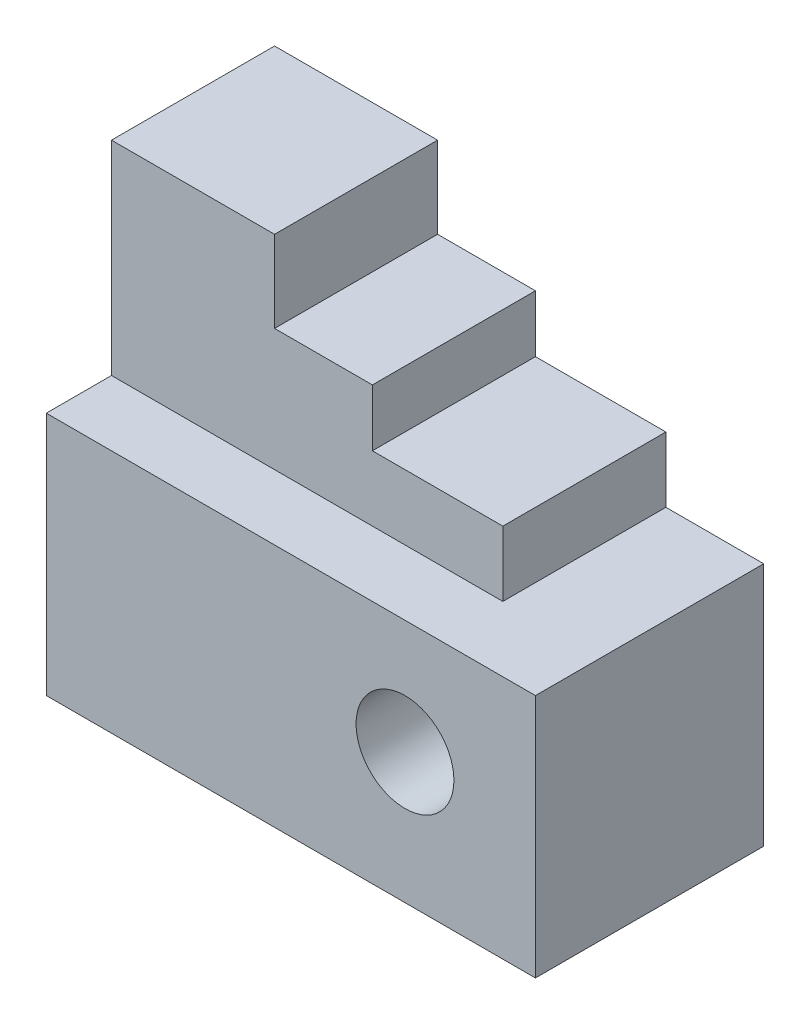
ISO-10303-21;
HEADER;
FILE_DESCRIPTION(('STEP AP214'),'2;1');
FILE_NAME('part.step','',(''),(''),'','','');
FILE_SCHEMA(('AUTOMOTIVE_DESIGN { 1 0 10303 214 1 1 1 1 }'));
ENDSEC;
DATA;
#1=APPLICATION_CONTEXT('core data for automotive mechanical design processes');
#2=APPLICATION_PROTOCOL_DEFINITION('international standard','automotive_design',2000,#1);
#3=PRODUCT_CONTEXT('',#1,'mechanical');
#4=PRODUCT('Part','Part','',(#3));
#5=PRODUCT_RELATED_PRODUCT_CATEGORY('part','',(#4));
#6=PRODUCT_DEFINITION_FORMATION('','',#4);
#7=PRODUCT_DEFINITION_CONTEXT('part definition',#1,'design');
#8=PRODUCT_DEFINITION('design','',#6,#7);
#9=PRODUCT_DEFINITION_SHAPE('','',#8);
#10=(LENGTH_UNIT() NAMED_UNIT(*) SI_UNIT(.MILLI.,.METRE.));
#11=(NAMED_UNIT(*) PLANE_ANGLE_UNIT() SI_UNIT($,.RADIAN.));
#12=(NAMED_UNIT(*) SI_UNIT($,.STERADIAN.) SOLID_ANGLE_UNIT());
#13=UNCERTAINTY_MEASURE_WITH_UNIT(LENGTH_MEASURE(1.E-05),#10,'distance_accuracy_value','');
#14=(GEOMETRIC_REPRESENTATION_CONTEXT(3) GLOBAL_UNCERTAINTY_ASSIGNED_CONTEXT((#13)) GLOBAL_UNIT_ASSIGNED_CONTEXT((#10,
#11,#12)) REPRESENTATION_CONTEXT('',''));
#15=CARTESIAN_POINT('',(0.,0.,0.));
#16=DIRECTION('',(0.,0.,1.));
#17=DIRECTION('',(1.,0.,0.));
#18=AXIS2_PLACEMENT_3D('',#15,#16,#17);
#19=CARTESIAN_POINT('',(0.,30.,28.));
#20=DIRECTION('',(0.,-1.,0.));
#21=DIRECTION('',(0.,0.,-1.));
#22=AXIS2_PLACEMENT_3D('',#19,#20,#21);
#23=PLANE('',#22);
#24=DIRECTION('',(0.,0.,-1.));
#25=VECTOR('',#24,1.);
#26=CARTESIAN_POINT('',(48.,30.,20.));
#27=LINE('',#26,#25);
#28=CARTESIAN_POINT('',(48.,30.,20.));
#29=VERTEX_POINT('',#28);
#30=CARTESIAN_POINT('',(48.,30.,0.));
#31=VERTEX_POINT('',#30);
#32=EDGE_CURVE('E155',#29,#31,#27,.T.);
#33=ORIENTED_EDGE('',*,*,#32,.F.);
#34=DIRECTION('',(-1.,0.,0.));
#35=VECTOR('',#34,1.);
#36=CARTESIAN_POINT('',(0.,30.,20.));
#37=LINE('',#36,#35);
#38=CARTESIAN_POINT('',(0.,30.,20.));
#39=VERTEX_POINT('',#38);
#40=EDGE_CURVE('E59',#29,#39,#37,.T.);
#41=ORIENTED_EDGE('',*,*,#40,.T.);
#42=DIRECTION('',(0.,0.,-1.));
#43=VECTOR('',#42,1.);
#44=CARTESIAN_POINT('',(0.,30.,28.));
#45=LINE('',#44,#43);
#46=CARTESIAN_POINT('',(0.,30.,28.));
#47=VERTEX_POINT('',#46);
#48=EDGE_CURVE('E234',#47,#39,#45,.T.);
#49=ORIENTED_EDGE('',*,*,#48,.F.);
#50=DIRECTION('',(-1.,0.,0.));
#51=VECTOR('',#50,1.);
#52=CARTESIAN_POINT('',(0.,30.,28.));
#53=LINE('',#52,#51);
#54=CARTESIAN_POINT('',(60.,30.,28.));
#55=VERTEX_POINT('',#54);
#56=EDGE_CURVE('E231',#55,#47,#53,.T.);
#57=ORIENTED_EDGE('',*,*,#56,.F.);
#58=DIRECTION('',(0.,0.,-1.));
#59=VECTOR('',#58,1.);
#60=CARTESIAN_POINT('',(60.,30.,28.));
#61=LINE('',#60,#59);
#62=CARTESIAN_POINT('',(60.,30.,0.));
#63=VERTEX_POINT('',#62);
#64=EDGE_CURVE('E249',#55,#63,#61,.T.);
#65=ORIENTED_EDGE('',*,*,#64,.T.);
#66=DIRECTION('',(-1.,0.,0.));
#67=VECTOR('',#66,1.);
#68=CARTESIAN_POINT('',(0.,30.,0.));
#69=LINE('',#68,#67);
#70=EDGE_CURVE('E66',#63,#31,#69,.T.);
#71=ORIENTED_EDGE('',*,*,#70,.T.);
#72=EDGE_LOOP('',(#33,#41,#49,#57,#65,#71));
#73=FACE_BOUND('',#72,.T.);
#74=ADVANCED_FACE('F43',(#73),#23,.F.);
#75=CARTESIAN_POINT('',(32.,45.,0.));
#76=DIRECTION('',(-1.,0.,0.));
#77=DIRECTION('',(0.,0.,1.));
#78=AXIS2_PLACEMENT_3D('',#75,#76,#77);
#79=PLANE('',#78);
#80=DIRECTION('',(0.,0.,1.));
#81=VECTOR('',#80,1.);
#82=CARTESIAN_POINT('',(32.,38.,20.));
#83=LINE('',#82,#81);
#84=CARTESIAN_POINT('',(32.,38.,0.));
#85=VERTEX_POINT('',#84);
#86=CARTESIAN_POINT('',(32.,38.,20.));
#87=VERTEX_POINT('',#86);
#88=EDGE_CURVE('E133',#85,#87,#83,.T.);
#89=ORIENTED_EDGE('',*,*,#88,.F.);
#90=DIRECTION('',(0.,-1.,0.));
#91=VECTOR('',#90,1.);
#92=CARTESIAN_POINT('',(32.,45.,0.));
#93=LINE('',#92,#91);
#94=CARTESIAN_POINT('',(32.,45.,0.));
#95=VERTEX_POINT('',#94);
#96=EDGE_CURVE('E139',#95,#85,#93,.T.);
#97=ORIENTED_EDGE('',*,*,#96,.F.);
#98=DIRECTION('',(0.,0.,-1.));
#99=VECTOR('',#98,1.);
#100=CARTESIAN_POINT('',(32.,45.,0.));
#101=LINE('',#100,#99);
#102=CARTESIAN_POINT('',(32.,45.,20.));
#103=VERTEX_POINT('',#102);
#104=EDGE_CURVE('E135',#103,#95,#101,.T.);
#105=ORIENTED_EDGE('',*,*,#104,.F.);
#106=DIRECTION('',(0.,-1.,0.));
#107=VECTOR('',#106,1.);
#108=CARTESIAN_POINT('',(32.,45.,20.));
#109=LINE('',#108,#107);
#110=EDGE_CURVE('E128',#103,#87,#109,.T.);
#111=ORIENTED_EDGE('',*,*,#110,.T.);
#112=EDGE_LOOP('',(#89,#97,#105,#111));
#113=FACE_BOUND('',#112,.T.);
#114=ADVANCED_FACE('F130',(#113),#79,.F.);
#115=CARTESIAN_POINT('',(20.,55.,0.));
#116=DIRECTION('',(1.,0.,0.));
#117=DIRECTION('',(0.,0.,-1.));
#118=AXIS2_PLACEMENT_3D('',#115,#116,#117);
#119=PLANE('',#118);
#120=DIRECTION('',(0.,-1.,0.));
#121=VECTOR('',#120,1.);
#122=CARTESIAN_POINT('',(20.,55.,20.));
#123=LINE('',#122,#121);
#124=CARTESIAN_POINT('',(20.,55.,20.));
#125=VERTEX_POINT('',#124);
#126=CARTESIAN_POINT('',(20.,45.,20.));
#127=VERTEX_POINT('',#126);
#128=EDGE_CURVE('E200',#125,#127,#123,.T.);
#129=ORIENTED_EDGE('',*,*,#128,.T.);
#130=DIRECTION('',(0.,0.,1.));
#131=VECTOR('',#130,1.);
#132=CARTESIAN_POINT('',(20.,45.,20.));
#133=LINE('',#132,#131);
#134=CARTESIAN_POINT('',(20.,45.,0.));
#135=VERTEX_POINT('',#134);
#136=EDGE_CURVE('E179',#135,#127,#133,.T.);
#137=ORIENTED_EDGE('',*,*,#136,.F.);
#138=DIRECTION('',(0.,-1.,0.));
#139=VECTOR('',#138,1.);
#140=CARTESIAN_POINT('',(20.,55.,0.));
#141=LINE('',#140,#139);
#142=CARTESIAN_POINT('',(20.,55.,0.));
#143=VERTEX_POINT('',#142);
#144=EDGE_CURVE('E208',#143,#135,#141,.T.);
#145=ORIENTED_EDGE('',*,*,#144,.F.);
#146=DIRECTION('',(0.,0.,1.));
#147=VECTOR('',#146,1.);
#148=CARTESIAN_POINT('',(20.,55.,0.));
#149=LINE('',#148,#147);
#150=EDGE_CURVE('E185',#143,#125,#149,.T.);
#151=ORIENTED_EDGE('',*,*,#150,.T.);
#152=EDGE_LOOP('',(#129,#137,#145,#151));
#153=FACE_BOUND('',#152,.T.);
#154=ADVANCED_FACE('F281',(#153),#119,.T.);
#155=CARTESIAN_POINT('',(0.,0.,28.));
#156=DIRECTION('',(1.,0.,0.));
#157=DIRECTION('',(0.,0.,-1.));
#158=AXIS2_PLACEMENT_3D('',#155,#156,#157);
#159=PLANE('',#158);
#160=DIRECTION('',(0.,-1.,0.));
#161=VECTOR('',#160,1.);
#162=CARTESIAN_POINT('',(0.,0.,0.));
#163=LINE('',#162,#161);
#164=CARTESIAN_POINT('',(0.,55.,0.));
#165=VERTEX_POINT('',#164);
#166=CARTESIAN_POINT('',(0.,0.,0.));
#167=VERTEX_POINT('',#166);
#168=EDGE_CURVE('E217',#165,#167,#163,.T.);
#169=ORIENTED_EDGE('',*,*,#168,.T.);
#170=DIRECTION('',(0.,0.,-1.));
#171=VECTOR('',#170,1.);
#172=CARTESIAN_POINT('',(0.,0.,28.));
#173=LINE('',#172,#171);
#174=CARTESIAN_POINT('',(0.,0.,28.));
#175=VERTEX_POINT('',#174);
#176=EDGE_CURVE('E11',#175,#167,#173,.T.);
#177=ORIENTED_EDGE('',*,*,#176,.F.);
#178=DIRECTION('',(0.,-1.,0.));
#179=VECTOR('',#178,1.);
#180=CARTESIAN_POINT('',(0.,0.,28.));
#181=LINE('',#180,#179);
#182=EDGE_CURVE('E221',#47,#175,#181,.T.);
#183=ORIENTED_EDGE('',*,*,#182,.F.);
#184=ORIENTED_EDGE('',*,*,#48,.T.);
#185=DIRECTION('',(0.,-1.,0.));
#186=VECTOR('',#185,1.);
#187=CARTESIAN_POINT('',(0.,55.,20.));
#188=LINE('',#187,#186);
#189=CARTESIAN_POINT('',(0.,55.,20.));
#190=VERTEX_POINT('',#189);
#191=EDGE_CURVE('E205',#190,#39,#188,.T.);
#192=ORIENTED_EDGE('',*,*,#191,.F.);
#193=DIRECTION('',(0.,0.,1.));
#194=VECTOR('',#193,1.);
#195=CARTESIAN_POINT('',(0.,55.,0.));
#196=LINE('',#195,#194);
#197=EDGE_CURVE('E193',#165,#190,#196,.T.);
#198=ORIENTED_EDGE('',*,*,#197,.F.);
#199=EDGE_LOOP('',(#169,#177,#183,#184,#192,#198));
#200=FACE_BOUND('',#199,.T.);
#201=ADVANCED_FACE('F45',(#200),#159,.F.);
#202=CARTESIAN_POINT('',(0.,0.,28.));
#203=DIRECTION('',(0.,1.,0.));
#204=DIRECTION('',(0.,0.,1.));
#205=AXIS2_PLACEMENT_3D('',#202,#203,#204);
#206=PLANE('',#205);
#207=DIRECTION('',(1.,0.,0.));
#208=VECTOR('',#207,1.);
#209=CARTESIAN_POINT('',(0.,0.,0.));
#210=LINE('',#209,#208);
#211=CARTESIAN_POINT('',(60.,0.,0.));
#212=VERTEX_POINT('',#211);
#213=EDGE_CURVE('E238',#167,#212,#210,.T.);
#214=ORIENTED_EDGE('',*,*,#213,.T.);
#215=DIRECTION('',(0.,0.,-1.));
#216=VECTOR('',#215,1.);
#217=CARTESIAN_POINT('',(60.,0.,28.));
#218=LINE('',#217,#216);
#219=CARTESIAN_POINT('',(60.,0.,28.));
#220=VERTEX_POINT('',#219);
#221=EDGE_CURVE('E52',#220,#212,#218,.T.);
#222=ORIENTED_EDGE('',*,*,#221,.F.);
#223=DIRECTION('',(1.,0.,0.));
#224=VECTOR('',#223,1.);
#225=CARTESIAN_POINT('',(0.,0.,28.));
#226=LINE('',#225,#224);
#227=EDGE_CURVE('E225',#175,#220,#226,.T.);
#228=ORIENTED_EDGE('',*,*,#227,.F.);
#229=ORIENTED_EDGE('',*,*,#176,.T.);
#230=EDGE_LOOP('',(#214,#222,#228,#229));
#231=FACE_BOUND('',#230,.T.);
#232=ADVANCED_FACE('F274',(#231),#206,.F.);
#233=CARTESIAN_POINT('',(60.,30.,28.));
#234=DIRECTION('',(-1.,0.,0.));
#235=DIRECTION('',(0.,0.,1.));
#236=AXIS2_PLACEMENT_3D('',#233,#234,#235);
#237=PLANE('',#236);
#238=DIRECTION('',(0.,1.,0.));
#239=VECTOR('',#238,1.);
#240=CARTESIAN_POINT('',(60.,30.,0.));
#241=LINE('',#240,#239);
#242=EDGE_CURVE('E241',#212,#63,#241,.T.);
#243=ORIENTED_EDGE('',*,*,#242,.T.);
#244=ORIENTED_EDGE('',*,*,#64,.F.);
#245=DIRECTION('',(0.,1.,0.));
#246=VECTOR('',#245,1.);
#247=CARTESIAN_POINT('',(60.,30.,28.));
#248=LINE('',#247,#246);
#249=EDGE_CURVE('E228',#220,#55,#248,.T.);
#250=ORIENTED_EDGE('',*,*,#249,.F.);
#251=ORIENTED_EDGE('',*,*,#221,.T.);
#252=EDGE_LOOP('',(#243,#244,#250,#251));
#253=FACE_BOUND('',#252,.T.);
#254=ADVANCED_FACE('F257',(#253),#237,.F.);
#255=CARTESIAN_POINT('',(0.,0.,28.));
#256=DIRECTION('',(0.,0.,-1.));
#257=DIRECTION('',(-1.,0.,0.));
#258=AXIS2_PLACEMENT_3D('',#255,#256,#257);
#259=PLANE('',#258);
#260=CARTESIAN_POINT('',(44.,16.,28.));
#261=DIRECTION('',(0.,0.,1.));
#262=DIRECTION('',(1.,0.,0.));
#263=AXIS2_PLACEMENT_3D('',#260,#261,#262);
#264=CIRCLE('',#263,6.);
#265=CARTESIAN_POINT('',(50.,16.,28.));
#266=VERTEX_POINT('',#265);
#267=EDGE_CURVE('E212',#266,#266,#264,.T.);
#268=ORIENTED_EDGE('',*,*,#267,.F.);
#269=EDGE_LOOP('',(#268));
#270=FACE_BOUND('',#269,.T.);
#271=ORIENTED_EDGE('',*,*,#182,.T.);
#272=ORIENTED_EDGE('',*,*,#227,.T.);
#273=ORIENTED_EDGE('',*,*,#249,.T.);
#274=ORIENTED_EDGE('',*,*,#56,.T.);
#275=EDGE_LOOP('',(#271,#272,#273,#274));
#276=FACE_BOUND('',#275,.T.);
#277=ADVANCED_FACE('F273',(#270,#276),#259,.F.);
#278=CARTESIAN_POINT('',(0.,0.,0.));
#279=DIRECTION('',(0.,0.,-1.));
#280=DIRECTION('',(-1.,0.,0.));
#281=AXIS2_PLACEMENT_3D('',#278,#279,#280);
#282=PLANE('',#281);
#283=CARTESIAN_POINT('',(44.,16.,0.));
#284=DIRECTION('',(0.,0.,1.));
#285=DIRECTION('',(1.,0.,0.));
#286=AXIS2_PLACEMENT_3D('',#283,#284,#285);
#287=CIRCLE('',#286,6.);
#288=CARTESIAN_POINT('',(50.,16.,0.));
#289=VERTEX_POINT('',#288);
#290=EDGE_CURVE('E213',#289,#289,#287,.T.);
#291=ORIENTED_EDGE('',*,*,#290,.T.);
#292=EDGE_LOOP('',(#291));
#293=FACE_BOUND('',#292,.T.);
#294=ORIENTED_EDGE('',*,*,#168,.F.);
#295=DIRECTION('',(-1.,0.,0.));
#296=VECTOR('',#295,1.);
#297=CARTESIAN_POINT('',(0.,55.,0.));
#298=LINE('',#297,#296);
#299=EDGE_CURVE('E189',#143,#165,#298,.T.);
#300=ORIENTED_EDGE('',*,*,#299,.F.);
#301=ORIENTED_EDGE('',*,*,#144,.T.);
#302=DIRECTION('',(-1.,0.,0.));
#303=VECTOR('',#302,1.);
#304=CARTESIAN_POINT('',(20.,45.,0.));
#305=LINE('',#304,#303);
#306=EDGE_CURVE('E175',#95,#135,#305,.T.);
#307=ORIENTED_EDGE('',*,*,#306,.F.);
#308=ORIENTED_EDGE('',*,*,#96,.T.);
#309=DIRECTION('',(-1.,0.,0.));
#310=VECTOR('',#309,1.);
#311=CARTESIAN_POINT('',(32.,38.,0.));
#312=LINE('',#311,#310);
#313=CARTESIAN_POINT('',(48.,38.,0.));
#314=VERTEX_POINT('',#313);
#315=EDGE_CURVE('E153',#314,#85,#312,.T.);
#316=ORIENTED_EDGE('',*,*,#315,.F.);
#317=DIRECTION('',(0.,-1.,0.));
#318=VECTOR('',#317,1.);
#319=CARTESIAN_POINT('',(48.,38.,0.));
#320=LINE('',#319,#318);
#321=EDGE_CURVE('E163',#314,#31,#320,.T.);
#322=ORIENTED_EDGE('',*,*,#321,.T.);
#323=ORIENTED_EDGE('',*,*,#70,.F.);
#324=ORIENTED_EDGE('',*,*,#242,.F.);
#325=ORIENTED_EDGE('',*,*,#213,.F.);
#326=EDGE_LOOP('',(#294,#300,#301,#307,#308,#316,#322,#323,#324,#325));
#327=FACE_BOUND('',#326,.T.);
#328=ADVANCED_FACE('F261',(#293,#327),#282,.T.);
#329=CARTESIAN_POINT('',(44.,16.,0.));
#330=DIRECTION('',(0.,0.,1.));
#331=DIRECTION('',(1.,0.,0.));
#332=AXIS2_PLACEMENT_3D('',#329,#330,#331);
#333=CYLINDRICAL_SURFACE('',#332,6.);
#334=ORIENTED_EDGE('',*,*,#290,.F.);
#335=EDGE_LOOP('',(#334));
#336=FACE_BOUND('',#335,.T.);
#337=ORIENTED_EDGE('',*,*,#267,.T.);
#338=EDGE_LOOP('',(#337));
#339=FACE_BOUND('',#338,.T.);
#340=ADVANCED_FACE('F315',(#336,#339),#333,.F.);
#341=CARTESIAN_POINT('',(0.,55.,20.));
#342=DIRECTION('',(0.,0.,1.));
#343=DIRECTION('',(1.,0.,0.));
#344=AXIS2_PLACEMENT_3D('',#341,#342,#343);
#345=PLANE('',#344);
#346=ORIENTED_EDGE('',*,*,#40,.F.);
#347=DIRECTION('',(0.,-1.,0.));
#348=VECTOR('',#347,1.);
#349=CARTESIAN_POINT('',(48.,38.,20.));
#350=LINE('',#349,#348);
#351=CARTESIAN_POINT('',(48.,38.,20.));
#352=VERTEX_POINT('',#351);
#353=EDGE_CURVE('E144',#352,#29,#350,.T.);
#354=ORIENTED_EDGE('',*,*,#353,.F.);
#355=DIRECTION('',(1.,0.,0.));
#356=VECTOR('',#355,1.);
#357=CARTESIAN_POINT('',(32.,38.,20.));
#358=LINE('',#357,#356);
#359=EDGE_CURVE('E141',#87,#352,#358,.T.);
#360=ORIENTED_EDGE('',*,*,#359,.F.);
#361=ORIENTED_EDGE('',*,*,#110,.F.);
#362=DIRECTION('',(1.,0.,0.));
#363=VECTOR('',#362,1.);
#364=CARTESIAN_POINT('',(20.,45.,20.));
#365=LINE('',#364,#363);
#366=EDGE_CURVE('E170',#127,#103,#365,.T.);
#367=ORIENTED_EDGE('',*,*,#366,.F.);
#368=ORIENTED_EDGE('',*,*,#128,.F.);
#369=DIRECTION('',(-1.,0.,0.));
#370=VECTOR('',#369,1.);
#371=CARTESIAN_POINT('',(0.,55.,20.));
#372=LINE('',#371,#370);
#373=EDGE_CURVE('E196',#125,#190,#372,.T.);
#374=ORIENTED_EDGE('',*,*,#373,.T.);
#375=ORIENTED_EDGE('',*,*,#191,.T.);
#376=EDGE_LOOP('',(#346,#354,#360,#361,#367,#368,#374,#375));
#377=FACE_BOUND('',#376,.T.);
#378=ADVANCED_FACE('F142',(#377),#345,.T.);
#379=CARTESIAN_POINT('',(0.,55.,0.));
#380=DIRECTION('',(0.,1.,0.));
#381=DIRECTION('',(0.,0.,1.));
#382=AXIS2_PLACEMENT_3D('',#379,#380,#381);
#383=PLANE('',#382);
#384=ORIENTED_EDGE('',*,*,#150,.F.);
#385=ORIENTED_EDGE('',*,*,#299,.T.);
#386=ORIENTED_EDGE('',*,*,#197,.T.);
#387=ORIENTED_EDGE('',*,*,#373,.F.);
#388=EDGE_LOOP('',(#384,#385,#386,#387));
#389=FACE_BOUND('',#388,.T.);
#390=ADVANCED_FACE('F278',(#389),#383,.T.);
#391=CARTESIAN_POINT('',(0.,45.,0.));
#392=DIRECTION('',(0.,-1.,0.));
#393=DIRECTION('',(0.,0.,-1.));
#394=AXIS2_PLACEMENT_3D('',#391,#392,#393);
#395=PLANE('',#394);
#396=ORIENTED_EDGE('',*,*,#366,.T.);
#397=ORIENTED_EDGE('',*,*,#104,.T.);
#398=ORIENTED_EDGE('',*,*,#306,.T.);
#399=ORIENTED_EDGE('',*,*,#136,.T.);
#400=EDGE_LOOP('',(#396,#397,#398,#399));
#401=FACE_BOUND('',#400,.T.);
#402=ADVANCED_FACE('F284',(#401),#395,.F.);
#403=CARTESIAN_POINT('',(48.,38.,20.));
#404=DIRECTION('',(-1.,0.,0.));
#405=DIRECTION('',(0.,0.,1.));
#406=AXIS2_PLACEMENT_3D('',#403,#404,#405);
#407=PLANE('',#406);
#408=ORIENTED_EDGE('',*,*,#32,.T.);
#409=ORIENTED_EDGE('',*,*,#321,.F.);
#410=DIRECTION('',(0.,0.,-1.));
#411=VECTOR('',#410,1.);
#412=CARTESIAN_POINT('',(48.,38.,20.));
#413=LINE('',#412,#411);
#414=EDGE_CURVE('E148',#352,#314,#413,.T.);
#415=ORIENTED_EDGE('',*,*,#414,.F.);
#416=ORIENTED_EDGE('',*,*,#353,.T.);
#417=EDGE_LOOP('',(#408,#409,#415,#416));
#418=FACE_BOUND('',#417,.T.);
#419=ADVANCED_FACE('F264',(#418),#407,.F.);
#420=CARTESIAN_POINT('',(0.,38.,0.));
#421=DIRECTION('',(0.,-1.,0.));
#422=DIRECTION('',(0.,0.,-1.));
#423=AXIS2_PLACEMENT_3D('',#420,#421,#422);
#424=PLANE('',#423);
#425=ORIENTED_EDGE('',*,*,#88,.T.);
#426=ORIENTED_EDGE('',*,*,#359,.T.);
#427=ORIENTED_EDGE('',*,*,#414,.T.);
#428=ORIENTED_EDGE('',*,*,#315,.T.);
#429=EDGE_LOOP('',(#425,#426,#427,#428));
#430=FACE_BOUND('',#429,.T.);
#431=ADVANCED_FACE('F151',(#430),#424,.F.);
#432=CLOSED_SHELL('',(#74,#114,#154,#201,#232,#254,#277,#328,#340,#378,#390,#402,#419,#431));
#433=MANIFOLD_SOLID_BREP('B2',#432);
#434=ADVANCED_BREP_SHAPE_REPRESENTATION('',(#18,#433),#14);
#435=SHAPE_DEFINITION_REPRESENTATION(#9,#434);
ENDSEC;
END-ISO-10303-21;
